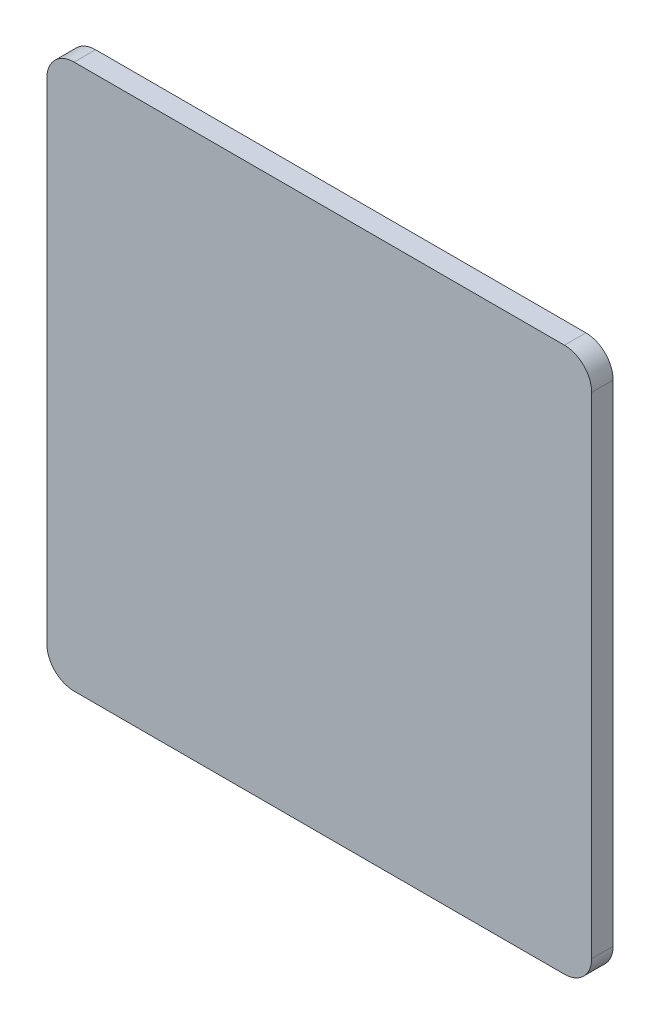
ISO-10303-21;
HEADER;
FILE_DESCRIPTION(('STEP AP214'),'2;1');
FILE_NAME('part.step','',(''),(''),'','','');
FILE_SCHEMA(('AUTOMOTIVE_DESIGN { 1 0 10303 214 1 1 1 1 }'));
ENDSEC;
DATA;
#1=APPLICATION_CONTEXT('core data for automotive mechanical design processes');
#2=APPLICATION_PROTOCOL_DEFINITION('international standard','automotive_design',2000,#1);
#3=PRODUCT_CONTEXT('',#1,'mechanical');
#4=PRODUCT('Part','Part','',(#3));
#5=PRODUCT_RELATED_PRODUCT_CATEGORY('part','',(#4));
#6=PRODUCT_DEFINITION_FORMATION('','',#4);
#7=PRODUCT_DEFINITION_CONTEXT('part definition',#1,'design');
#8=PRODUCT_DEFINITION('design','',#6,#7);
#9=PRODUCT_DEFINITION_SHAPE('','',#8);
#10=(LENGTH_UNIT() NAMED_UNIT(*) SI_UNIT(.MILLI.,.METRE.));
#11=(NAMED_UNIT(*) PLANE_ANGLE_UNIT() SI_UNIT($,.RADIAN.));
#12=(NAMED_UNIT(*) SI_UNIT($,.STERADIAN.) SOLID_ANGLE_UNIT());
#13=UNCERTAINTY_MEASURE_WITH_UNIT(LENGTH_MEASURE(1.E-05),#10,'distance_accuracy_value','');
#14=(GEOMETRIC_REPRESENTATION_CONTEXT(3) GLOBAL_UNCERTAINTY_ASSIGNED_CONTEXT((#13)) GLOBAL_UNIT_ASSIGNED_CONTEXT((#10,
#11,#12)) REPRESENTATION_CONTEXT('',''));
#15=CARTESIAN_POINT('',(0.,0.,0.));
#16=DIRECTION('',(0.,0.,1.));
#17=DIRECTION('',(1.,0.,0.));
#18=AXIS2_PLACEMENT_3D('',#15,#16,#17);
#19=CARTESIAN_POINT('',(-63.5,0.,5.));
#20=DIRECTION('',(-1.,0.,0.));
#21=DIRECTION('',(0.,0.,1.));
#22=AXIS2_PLACEMENT_3D('',#19,#20,#21);
#23=PLANE('',#22);
#24=DIRECTION('',(0.,1.,0.));
#25=VECTOR('',#24,1.);
#26=CARTESIAN_POINT('',(-63.5,0.,0.));
#27=LINE('',#26,#25);
#28=CARTESIAN_POINT('',(-63.5,-57.15,0.));
#29=VERTEX_POINT('',#28);
#30=CARTESIAN_POINT('',(-63.5,57.15,0.));
#31=VERTEX_POINT('',#30);
#32=EDGE_CURVE('E109',#29,#31,#27,.T.);
#33=ORIENTED_EDGE('',*,*,#32,.F.);
#34=DIRECTION('',(0.,0.,-1.));
#35=VECTOR('',#34,1.);
#36=CARTESIAN_POINT('',(-63.5,-57.15,5.));
#37=LINE('',#36,#35);
#38=CARTESIAN_POINT('',(-63.5,-57.15,5.));
#39=VERTEX_POINT('',#38);
#40=EDGE_CURVE('E11',#29,#39,#37,.F.);
#41=ORIENTED_EDGE('',*,*,#40,.T.);
#42=DIRECTION('',(0.,1.,0.));
#43=VECTOR('',#42,1.);
#44=CARTESIAN_POINT('',(-63.5,0.,5.));
#45=LINE('',#44,#43);
#46=CARTESIAN_POINT('',(-63.5,57.15,5.));
#47=VERTEX_POINT('',#46);
#48=EDGE_CURVE('E124',#39,#47,#45,.T.);
#49=ORIENTED_EDGE('',*,*,#48,.T.);
#50=DIRECTION('',(0.,0.,-1.));
#51=VECTOR('',#50,1.);
#52=CARTESIAN_POINT('',(-63.5,57.15,5.));
#53=LINE('',#52,#51);
#54=EDGE_CURVE('E46',#47,#31,#53,.T.);
#55=ORIENTED_EDGE('',*,*,#54,.T.);
#56=EDGE_LOOP('',(#33,#41,#49,#55));
#57=FACE_BOUND('',#56,.T.);
#58=ADVANCED_FACE('F38',(#57),#23,.T.);
#59=CARTESIAN_POINT('',(0.,-63.5,5.));
#60=DIRECTION('',(0.,1.,0.));
#61=DIRECTION('',(0.,0.,1.));
#62=AXIS2_PLACEMENT_3D('',#59,#60,#61);
#63=PLANE('',#62);
#64=DIRECTION('',(1.,0.,0.));
#65=VECTOR('',#64,1.);
#66=CARTESIAN_POINT('',(0.,-63.5,0.));
#67=LINE('',#66,#65);
#68=CARTESIAN_POINT('',(-57.15,-63.5,0.));
#69=VERTEX_POINT('',#68);
#70=CARTESIAN_POINT('',(57.15,-63.5,0.));
#71=VERTEX_POINT('',#70);
#72=EDGE_CURVE('E165',#69,#71,#67,.T.);
#73=ORIENTED_EDGE('',*,*,#72,.T.);
#74=DIRECTION('',(0.,0.,-1.));
#75=VECTOR('',#74,1.);
#76=CARTESIAN_POINT('',(57.15,-63.5,5.));
#77=LINE('',#76,#75);
#78=CARTESIAN_POINT('',(57.15,-63.5,5.));
#79=VERTEX_POINT('',#78);
#80=EDGE_CURVE('E53',#71,#79,#77,.F.);
#81=ORIENTED_EDGE('',*,*,#80,.T.);
#82=DIRECTION('',(1.,0.,0.));
#83=VECTOR('',#82,1.);
#84=CARTESIAN_POINT('',(0.,-63.5,5.));
#85=LINE('',#84,#83);
#86=CARTESIAN_POINT('',(-57.15,-63.5,5.));
#87=VERTEX_POINT('',#86);
#88=EDGE_CURVE('E158',#87,#79,#85,.T.);
#89=ORIENTED_EDGE('',*,*,#88,.F.);
#90=DIRECTION('',(0.,0.,-1.));
#91=VECTOR('',#90,1.);
#92=CARTESIAN_POINT('',(-57.15,-63.5,0.));
#93=LINE('',#92,#91);
#94=EDGE_CURVE('E152',#87,#69,#93,.T.);
#95=ORIENTED_EDGE('',*,*,#94,.T.);
#96=EDGE_LOOP('',(#73,#81,#89,#95));
#97=FACE_BOUND('',#96,.T.);
#98=ADVANCED_FACE('F181',(#97),#63,.F.);
#99=CARTESIAN_POINT('',(63.5,0.,5.));
#100=DIRECTION('',(-1.,0.,0.));
#101=DIRECTION('',(0.,0.,1.));
#102=AXIS2_PLACEMENT_3D('',#99,#100,#101);
#103=PLANE('',#102);
#104=DIRECTION('',(0.,1.,0.));
#105=VECTOR('',#104,1.);
#106=CARTESIAN_POINT('',(63.5,0.,0.));
#107=LINE('',#106,#105);
#108=CARTESIAN_POINT('',(63.5,-57.15,0.));
#109=VERTEX_POINT('',#108);
#110=CARTESIAN_POINT('',(63.5,57.15,0.));
#111=VERTEX_POINT('',#110);
#112=EDGE_CURVE('E125',#109,#111,#107,.T.);
#113=ORIENTED_EDGE('',*,*,#112,.T.);
#114=DIRECTION('',(0.,0.,-1.));
#115=VECTOR('',#114,1.);
#116=CARTESIAN_POINT('',(63.5,57.15,5.));
#117=LINE('',#116,#115);
#118=CARTESIAN_POINT('',(63.5,57.15,5.));
#119=VERTEX_POINT('',#118);
#120=EDGE_CURVE('E144',#111,#119,#117,.F.);
#121=ORIENTED_EDGE('',*,*,#120,.T.);
#122=DIRECTION('',(0.,1.,0.));
#123=VECTOR('',#122,1.);
#124=CARTESIAN_POINT('',(63.5,0.,5.));
#125=LINE('',#124,#123);
#126=CARTESIAN_POINT('',(63.5,-57.15,5.));
#127=VERTEX_POINT('',#126);
#128=EDGE_CURVE('E132',#127,#119,#125,.T.);
#129=ORIENTED_EDGE('',*,*,#128,.F.);
#130=DIRECTION('',(0.,0.,-1.));
#131=VECTOR('',#130,1.);
#132=CARTESIAN_POINT('',(63.5,-57.15,5.));
#133=LINE('',#132,#131);
#134=EDGE_CURVE('E141',#127,#109,#133,.T.);
#135=ORIENTED_EDGE('',*,*,#134,.T.);
#136=EDGE_LOOP('',(#113,#121,#129,#135));
#137=FACE_BOUND('',#136,.T.);
#138=ADVANCED_FACE('F170',(#137),#103,.F.);
#139=CARTESIAN_POINT('',(0.,63.5,5.));
#140=DIRECTION('',(0.,1.,0.));
#141=DIRECTION('',(0.,0.,1.));
#142=AXIS2_PLACEMENT_3D('',#139,#140,#141);
#143=PLANE('',#142);
#144=DIRECTION('',(1.,0.,0.));
#145=VECTOR('',#144,1.);
#146=CARTESIAN_POINT('',(0.,63.5,5.));
#147=LINE('',#146,#145);
#148=CARTESIAN_POINT('',(-57.15,63.5,5.));
#149=VERTEX_POINT('',#148);
#150=CARTESIAN_POINT('',(57.15,63.5,5.));
#151=VERTEX_POINT('',#150);
#152=EDGE_CURVE('E129',#149,#151,#147,.T.);
#153=ORIENTED_EDGE('',*,*,#152,.T.);
#154=DIRECTION('',(0.,0.,-1.));
#155=VECTOR('',#154,1.);
#156=CARTESIAN_POINT('',(57.15,63.5,0.));
#157=LINE('',#156,#155);
#158=CARTESIAN_POINT('',(57.15,63.5,0.));
#159=VERTEX_POINT('',#158);
#160=EDGE_CURVE('E115',#151,#159,#157,.T.);
#161=ORIENTED_EDGE('',*,*,#160,.T.);
#162=DIRECTION('',(1.,0.,0.));
#163=VECTOR('',#162,1.);
#164=CARTESIAN_POINT('',(0.,63.5,0.));
#165=LINE('',#164,#163);
#166=CARTESIAN_POINT('',(-57.15,63.5,0.));
#167=VERTEX_POINT('',#166);
#168=EDGE_CURVE('E107',#167,#159,#165,.T.);
#169=ORIENTED_EDGE('',*,*,#168,.F.);
#170=DIRECTION('',(0.,0.,-1.));
#171=VECTOR('',#170,1.);
#172=CARTESIAN_POINT('',(-57.15,63.5,5.));
#173=LINE('',#172,#171);
#174=EDGE_CURVE('E121',#167,#149,#173,.F.);
#175=ORIENTED_EDGE('',*,*,#174,.T.);
#176=EDGE_LOOP('',(#153,#161,#169,#175));
#177=FACE_BOUND('',#176,.T.);
#178=ADVANCED_FACE('F120',(#177),#143,.T.);
#179=CARTESIAN_POINT('',(0.,0.,5.));
#180=DIRECTION('',(0.,0.,1.));
#181=DIRECTION('',(1.,0.,0.));
#182=AXIS2_PLACEMENT_3D('',#179,#180,#181);
#183=PLANE('',#182);
#184=ORIENTED_EDGE('',*,*,#128,.T.);
#185=CARTESIAN_POINT('',(57.15,57.15,5.));
#186=DIRECTION('',(0.,0.,1.));
#187=DIRECTION('',(1.,0.,0.));
#188=AXIS2_PLACEMENT_3D('',#185,#186,#187);
#189=CIRCLE('',#188,6.35);
#190=EDGE_CURVE('E150',#119,#151,#189,.T.);
#191=ORIENTED_EDGE('',*,*,#190,.T.);
#192=ORIENTED_EDGE('',*,*,#152,.F.);
#193=CARTESIAN_POINT('',(-57.15,57.15,5.));
#194=DIRECTION('',(0.,0.,1.));
#195=DIRECTION('',(1.,0.,0.));
#196=AXIS2_PLACEMENT_3D('',#193,#194,#195);
#197=CIRCLE('',#196,6.35);
#198=EDGE_CURVE('E128',#149,#47,#197,.T.);
#199=ORIENTED_EDGE('',*,*,#198,.T.);
#200=ORIENTED_EDGE('',*,*,#48,.F.);
#201=CARTESIAN_POINT('',(-57.15,-57.15,5.));
#202=DIRECTION('',(0.,0.,1.));
#203=DIRECTION('',(1.,0.,0.));
#204=AXIS2_PLACEMENT_3D('',#201,#202,#203);
#205=CIRCLE('',#204,6.35);
#206=EDGE_CURVE('E60',#39,#87,#205,.T.);
#207=ORIENTED_EDGE('',*,*,#206,.T.);
#208=ORIENTED_EDGE('',*,*,#88,.T.);
#209=CARTESIAN_POINT('',(57.15,-57.15,5.));
#210=DIRECTION('',(0.,0.,1.));
#211=DIRECTION('',(1.,0.,0.));
#212=AXIS2_PLACEMENT_3D('',#209,#210,#211);
#213=CIRCLE('',#212,6.35);
#214=EDGE_CURVE('E148',#79,#127,#213,.T.);
#215=ORIENTED_EDGE('',*,*,#214,.T.);
#216=EDGE_LOOP('',(#184,#191,#192,#199,#200,#207,#208,#215));
#217=FACE_BOUND('',#216,.T.);
#218=ADVANCED_FACE('F176',(#217),#183,.T.);
#219=CARTESIAN_POINT('',(0.,0.,0.));
#220=DIRECTION('',(0.,0.,1.));
#221=DIRECTION('',(1.,0.,0.));
#222=AXIS2_PLACEMENT_3D('',#219,#220,#221);
#223=PLANE('',#222);
#224=ORIENTED_EDGE('',*,*,#168,.T.);
#225=CARTESIAN_POINT('',(57.15,57.15,0.));
#226=DIRECTION('',(0.,0.,1.));
#227=DIRECTION('',(1.,0.,0.));
#228=AXIS2_PLACEMENT_3D('',#225,#226,#227);
#229=CIRCLE('',#228,6.35);
#230=EDGE_CURVE('E139',#159,#111,#229,.F.);
#231=ORIENTED_EDGE('',*,*,#230,.T.);
#232=ORIENTED_EDGE('',*,*,#112,.F.);
#233=CARTESIAN_POINT('',(57.15,-57.15,0.));
#234=DIRECTION('',(0.,0.,1.));
#235=DIRECTION('',(1.,0.,0.));
#236=AXIS2_PLACEMENT_3D('',#233,#234,#235);
#237=CIRCLE('',#236,6.35);
#238=EDGE_CURVE('E137',#109,#71,#237,.F.);
#239=ORIENTED_EDGE('',*,*,#238,.T.);
#240=ORIENTED_EDGE('',*,*,#72,.F.);
#241=CARTESIAN_POINT('',(-57.15,-57.15,0.));
#242=DIRECTION('',(0.,0.,1.));
#243=DIRECTION('',(1.,0.,0.));
#244=AXIS2_PLACEMENT_3D('',#241,#242,#243);
#245=CIRCLE('',#244,6.35);
#246=EDGE_CURVE('E114',#69,#29,#245,.F.);
#247=ORIENTED_EDGE('',*,*,#246,.T.);
#248=ORIENTED_EDGE('',*,*,#32,.T.);
#249=CARTESIAN_POINT('',(-57.15,57.15,0.));
#250=DIRECTION('',(0.,0.,1.));
#251=DIRECTION('',(1.,0.,0.));
#252=AXIS2_PLACEMENT_3D('',#249,#250,#251);
#253=CIRCLE('',#252,6.35);
#254=EDGE_CURVE('E104',#31,#167,#253,.F.);
#255=ORIENTED_EDGE('',*,*,#254,.T.);
#256=EDGE_LOOP('',(#224,#231,#232,#239,#240,#247,#248,#255));
#257=FACE_BOUND('',#256,.T.);
#258=ADVANCED_FACE('F106',(#257),#223,.F.);
#259=CARTESIAN_POINT('',(57.15,57.15,5.));
#260=DIRECTION('',(0.,0.,1.));
#261=DIRECTION('',(1.,0.,0.));
#262=AXIS2_PLACEMENT_3D('',#259,#260,#261);
#263=CYLINDRICAL_SURFACE('',#262,6.35);
#264=ORIENTED_EDGE('',*,*,#190,.F.);
#265=ORIENTED_EDGE('',*,*,#120,.F.);
#266=ORIENTED_EDGE('',*,*,#230,.F.);
#267=ORIENTED_EDGE('',*,*,#160,.F.);
#268=EDGE_LOOP('',(#264,#265,#266,#267));
#269=FACE_BOUND('',#268,.T.);
#270=ADVANCED_FACE('F175',(#269),#263,.T.);
#271=CARTESIAN_POINT('',(57.15,-57.15,5.));
#272=DIRECTION('',(0.,0.,-1.));
#273=DIRECTION('',(-1.,0.,0.));
#274=AXIS2_PLACEMENT_3D('',#271,#272,#273);
#275=CYLINDRICAL_SURFACE('',#274,6.35);
#276=ORIENTED_EDGE('',*,*,#214,.F.);
#277=ORIENTED_EDGE('',*,*,#80,.F.);
#278=ORIENTED_EDGE('',*,*,#238,.F.);
#279=ORIENTED_EDGE('',*,*,#134,.F.);
#280=EDGE_LOOP('',(#276,#277,#278,#279));
#281=FACE_BOUND('',#280,.T.);
#282=ADVANCED_FACE('F179',(#281),#275,.T.);
#283=CARTESIAN_POINT('',(-57.15,-57.15,5.));
#284=DIRECTION('',(0.,0.,1.));
#285=DIRECTION('',(1.,0.,0.));
#286=AXIS2_PLACEMENT_3D('',#283,#284,#285);
#287=CYLINDRICAL_SURFACE('',#286,6.35);
#288=ORIENTED_EDGE('',*,*,#206,.F.);
#289=ORIENTED_EDGE('',*,*,#40,.F.);
#290=ORIENTED_EDGE('',*,*,#246,.F.);
#291=ORIENTED_EDGE('',*,*,#94,.F.);
#292=EDGE_LOOP('',(#288,#289,#290,#291));
#293=FACE_BOUND('',#292,.T.);
#294=ADVANCED_FACE('F184',(#293),#287,.T.);
#295=CARTESIAN_POINT('',(-57.15,57.15,5.));
#296=DIRECTION('',(0.,0.,-1.));
#297=DIRECTION('',(-1.,0.,0.));
#298=AXIS2_PLACEMENT_3D('',#295,#296,#297);
#299=CYLINDRICAL_SURFACE('',#298,6.35);
#300=ORIENTED_EDGE('',*,*,#198,.F.);
#301=ORIENTED_EDGE('',*,*,#174,.F.);
#302=ORIENTED_EDGE('',*,*,#254,.F.);
#303=ORIENTED_EDGE('',*,*,#54,.F.);
#304=EDGE_LOOP('',(#300,#301,#302,#303));
#305=FACE_BOUND('',#304,.T.);
#306=ADVANCED_FACE('F40',(#305),#299,.T.);
#307=CLOSED_SHELL('',(#58,#98,#138,#178,#218,#258,#270,#282,#294,#306));
#308=MANIFOLD_SOLID_BREP('B2',#307);
#309=ADVANCED_BREP_SHAPE_REPRESENTATION('',(#18,#308),#14);
#310=SHAPE_DEFINITION_REPRESENTATION(#9,#309);
ENDSEC;
END-ISO-10303-21;
